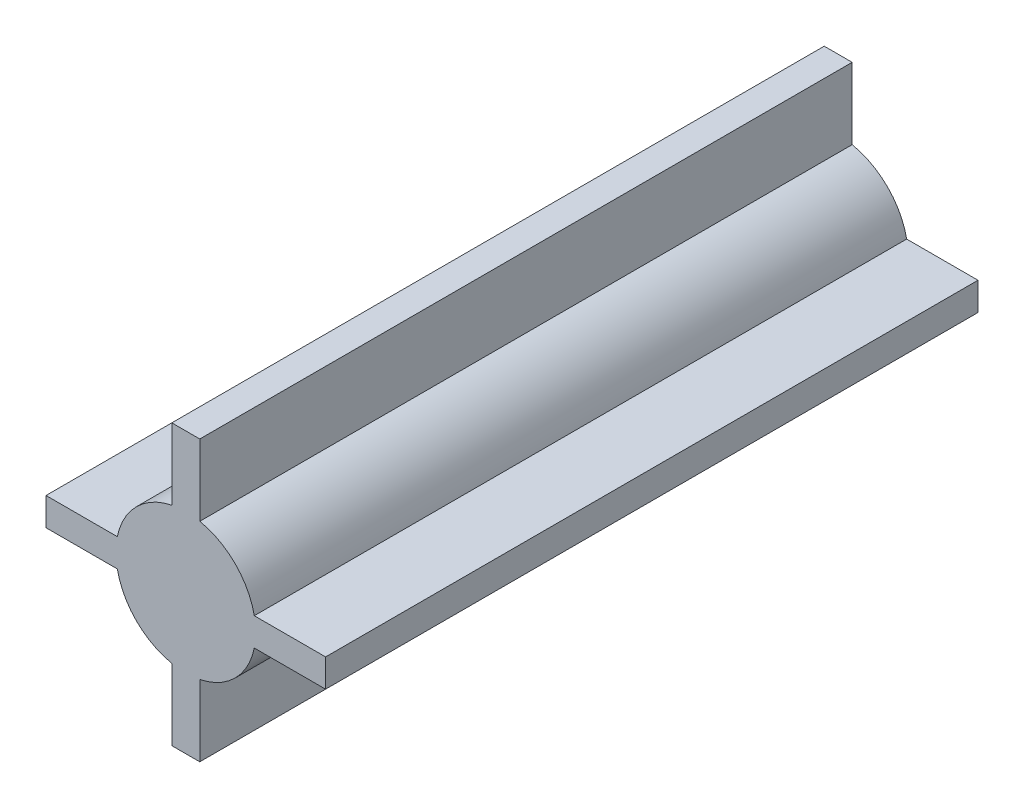
ISO-10303-21;
HEADER;
FILE_DESCRIPTION(('STEP AP214'),'2;1');
FILE_NAME('part.step','',(''),(''),'','','');
FILE_SCHEMA(('AUTOMOTIVE_DESIGN { 1 0 10303 214 1 1 1 1 }'));
ENDSEC;
DATA;
#1=APPLICATION_CONTEXT('core data for automotive mechanical design processes');
#2=APPLICATION_PROTOCOL_DEFINITION('international standard','automotive_design',2000,#1);
#3=PRODUCT_CONTEXT('',#1,'mechanical');
#4=PRODUCT('Part','Part','',(#3));
#5=PRODUCT_RELATED_PRODUCT_CATEGORY('part','',(#4));
#6=PRODUCT_DEFINITION_FORMATION('','',#4);
#7=PRODUCT_DEFINITION_CONTEXT('part definition',#1,'design');
#8=PRODUCT_DEFINITION('design','',#6,#7);
#9=PRODUCT_DEFINITION_SHAPE('','',#8);
#10=(LENGTH_UNIT() NAMED_UNIT(*) SI_UNIT(.MILLI.,.METRE.));
#11=(NAMED_UNIT(*) PLANE_ANGLE_UNIT() SI_UNIT($,.RADIAN.));
#12=(NAMED_UNIT(*) SI_UNIT($,.STERADIAN.) SOLID_ANGLE_UNIT());
#13=UNCERTAINTY_MEASURE_WITH_UNIT(LENGTH_MEASURE(1.E-05),#10,'distance_accuracy_value','');
#14=(GEOMETRIC_REPRESENTATION_CONTEXT(3) GLOBAL_UNCERTAINTY_ASSIGNED_CONTEXT((#13)) GLOBAL_UNIT_ASSIGNED_CONTEXT((#10,
#11,#12)) REPRESENTATION_CONTEXT('',''));
#15=CARTESIAN_POINT('',(0.,0.,0.));
#16=DIRECTION('',(0.,0.,1.));
#17=DIRECTION('',(1.,0.,0.));
#18=AXIS2_PLACEMENT_3D('',#15,#16,#17);
#19=CARTESIAN_POINT('',(0.,0.,0.));
#20=DIRECTION('',(0.,0.,-1.));
#21=DIRECTION('',(-1.,0.,0.));
#22=AXIS2_PLACEMENT_3D('',#19,#20,#21);
#23=PLANE('',#22);
#24=DIRECTION('',(0.,-1.,0.));
#25=VECTOR('',#24,1.);
#26=CARTESIAN_POINT('',(-1.50000000000038,14.9999999999995,0.));
#27=LINE('',#26,#25);
#28=CARTESIAN_POINT('',(-1.50000000000037,-7.34846922834946,0.));
#29=VERTEX_POINT('',#28);
#30=CARTESIAN_POINT('',(-1.50000000000037,-15.0000000000005,0.));
#31=VERTEX_POINT('',#30);
#32=EDGE_CURVE('E277',#29,#31,#27,.T.);
#33=ORIENTED_EDGE('',*,*,#32,.F.);
#34=CARTESIAN_POINT('',(0.,0.,0.));
#35=DIRECTION('',(0.,0.,1.));
#36=DIRECTION('',(1.,0.,0.));
#37=AXIS2_PLACEMENT_3D('',#34,#35,#36);
#38=CIRCLE('',#37,7.5);
#39=CARTESIAN_POINT('',(-7.34846922834953,-1.5,0.));
#40=VERTEX_POINT('',#39);
#41=EDGE_CURVE('E302',#40,#29,#38,.T.);
#42=ORIENTED_EDGE('',*,*,#41,.F.);
#43=DIRECTION('',(-1.,0.,0.));
#44=VECTOR('',#43,1.);
#45=CARTESIAN_POINT('',(15.,-1.5,0.));
#46=LINE('',#45,#44);
#47=CARTESIAN_POINT('',(-15.,-1.5,0.));
#48=VERTEX_POINT('',#47);
#49=EDGE_CURVE('E251',#40,#48,#46,.T.);
#50=ORIENTED_EDGE('',*,*,#49,.T.);
#51=DIRECTION('',(0.,1.,0.));
#52=VECTOR('',#51,1.);
#53=CARTESIAN_POINT('',(-15.,-1.5,0.));
#54=LINE('',#53,#52);
#55=CARTESIAN_POINT('',(-15.,1.5,0.));
#56=VERTEX_POINT('',#55);
#57=EDGE_CURVE('E248',#48,#56,#54,.T.);
#58=ORIENTED_EDGE('',*,*,#57,.T.);
#59=DIRECTION('',(-1.,0.,0.));
#60=VECTOR('',#59,1.);
#61=CARTESIAN_POINT('',(15.,1.5,0.));
#62=LINE('',#61,#60);
#63=CARTESIAN_POINT('',(-7.34846922834953,1.5,0.));
#64=VERTEX_POINT('',#63);
#65=EDGE_CURVE('E177',#64,#56,#62,.T.);
#66=ORIENTED_EDGE('',*,*,#65,.F.);
#67=CARTESIAN_POINT('',(-1.50000000000038,7.34846922834946,0.));
#68=VERTEX_POINT('',#67);
#69=EDGE_CURVE('E212',#68,#64,#38,.T.);
#70=ORIENTED_EDGE('',*,*,#69,.F.);
#71=CARTESIAN_POINT('',(-1.50000000000038,14.9999999999995,0.));
#72=VERTEX_POINT('',#71);
#73=EDGE_CURVE('E278',#72,#68,#27,.T.);
#74=ORIENTED_EDGE('',*,*,#73,.F.);
#75=DIRECTION('',(-1.,0.,0.));
#76=VECTOR('',#75,1.);
#77=CARTESIAN_POINT('',(1.49999999999962,14.9999999999995,0.));
#78=LINE('',#77,#76);
#79=CARTESIAN_POINT('',(1.49999999999962,14.9999999999995,0.));
#80=VERTEX_POINT('',#79);
#81=EDGE_CURVE('E222',#80,#72,#78,.T.);
#82=ORIENTED_EDGE('',*,*,#81,.F.);
#83=DIRECTION('',(0.,-1.,0.));
#84=VECTOR('',#83,1.);
#85=CARTESIAN_POINT('',(1.49999999999962,14.9999999999995,0.));
#86=LINE('',#85,#84);
#87=CARTESIAN_POINT('',(1.49999999999962,7.34846922834961,0.));
#88=VERTEX_POINT('',#87);
#89=EDGE_CURVE('E265',#80,#88,#86,.T.);
#90=ORIENTED_EDGE('',*,*,#89,.T.);
#91=CARTESIAN_POINT('',(7.34846922834953,1.5,0.));
#92=VERTEX_POINT('',#91);
#93=EDGE_CURVE('E303',#92,#88,#38,.T.);
#94=ORIENTED_EDGE('',*,*,#93,.F.);
#95=CARTESIAN_POINT('',(15.,1.5,0.));
#96=VERTEX_POINT('',#95);
#97=EDGE_CURVE('E245',#96,#92,#62,.T.);
#98=ORIENTED_EDGE('',*,*,#97,.F.);
#99=DIRECTION('',(0.,1.,0.));
#100=VECTOR('',#99,1.);
#101=CARTESIAN_POINT('',(15.,-1.5,0.));
#102=LINE('',#101,#100);
#103=CARTESIAN_POINT('',(15.,-1.5,0.));
#104=VERTEX_POINT('',#103);
#105=EDGE_CURVE('E230',#104,#96,#102,.T.);
#106=ORIENTED_EDGE('',*,*,#105,.F.);
#107=CARTESIAN_POINT('',(7.34846922834953,-1.5,0.));
#108=VERTEX_POINT('',#107);
#109=EDGE_CURVE('E233',#104,#108,#46,.T.);
#110=ORIENTED_EDGE('',*,*,#109,.T.);
#111=CARTESIAN_POINT('',(1.49999999999963,-7.34846922834961,0.));
#112=VERTEX_POINT('',#111);
#113=EDGE_CURVE('E299',#112,#108,#38,.T.);
#114=ORIENTED_EDGE('',*,*,#113,.F.);
#115=CARTESIAN_POINT('',(1.49999999999963,-15.0000000000005,0.));
#116=VERTEX_POINT('',#115);
#117=EDGE_CURVE('E284',#112,#116,#86,.T.);
#118=ORIENTED_EDGE('',*,*,#117,.T.);
#119=DIRECTION('',(-1.,0.,0.));
#120=VECTOR('',#119,1.);
#121=CARTESIAN_POINT('',(1.49999999999963,-15.0000000000005,0.));
#122=LINE('',#121,#120);
#123=EDGE_CURVE('E281',#116,#31,#122,.T.);
#124=ORIENTED_EDGE('',*,*,#123,.T.);
#125=EDGE_LOOP('',(#33,#42,#50,#58,#66,#70,#74,#82,#90,#94,#98,#106,#110,#114,#118,#124));
#126=FACE_BOUND('',#125,.T.);
#127=ADVANCED_FACE('F91',(#126),#23,.T.);
#128=CARTESIAN_POINT('',(15.,-1.5,70.));
#129=DIRECTION('',(-1.,0.,0.));
#130=DIRECTION('',(0.,0.,1.));
#131=AXIS2_PLACEMENT_3D('',#128,#129,#130);
#132=PLANE('',#131);
#133=ORIENTED_EDGE('',*,*,#105,.T.);
#134=DIRECTION('',(0.,0.,-1.));
#135=VECTOR('',#134,1.);
#136=CARTESIAN_POINT('',(15.,1.5,70.));
#137=LINE('',#136,#135);
#138=CARTESIAN_POINT('',(15.,1.5,70.));
#139=VERTEX_POINT('',#138);
#140=EDGE_CURVE('E244',#139,#96,#137,.T.);
#141=ORIENTED_EDGE('',*,*,#140,.F.);
#142=DIRECTION('',(0.,1.,0.));
#143=VECTOR('',#142,1.);
#144=CARTESIAN_POINT('',(15.,-1.5,70.));
#145=LINE('',#144,#143);
#146=CARTESIAN_POINT('',(15.,-1.5,70.));
#147=VERTEX_POINT('',#146);
#148=EDGE_CURVE('E241',#147,#139,#145,.T.);
#149=ORIENTED_EDGE('',*,*,#148,.F.);
#150=DIRECTION('',(0.,0.,-1.));
#151=VECTOR('',#150,1.);
#152=CARTESIAN_POINT('',(15.,-1.5,70.));
#153=LINE('',#152,#151);
#154=EDGE_CURVE('E256',#147,#104,#153,.T.);
#155=ORIENTED_EDGE('',*,*,#154,.T.);
#156=EDGE_LOOP('',(#133,#141,#149,#155));
#157=FACE_BOUND('',#156,.T.);
#158=ADVANCED_FACE('F326',(#157),#132,.F.);
#159=CARTESIAN_POINT('',(15.,1.5,70.));
#160=DIRECTION('',(0.,-1.,0.));
#161=DIRECTION('',(1.,0.,0.));
#162=AXIS2_PLACEMENT_3D('',#159,#160,#161);
#163=PLANE('',#162);
#164=DIRECTION('',(0.,0.,-1.));
#165=VECTOR('',#164,1.);
#166=CARTESIAN_POINT('',(7.34846922834953,1.5,70.));
#167=LINE('',#166,#165);
#168=CARTESIAN_POINT('',(7.34846922834953,1.5,70.));
#169=VERTEX_POINT('',#168);
#170=EDGE_CURVE('E12',#169,#92,#167,.T.);
#171=ORIENTED_EDGE('',*,*,#170,.F.);
#172=DIRECTION('',(-1.,0.,0.));
#173=VECTOR('',#172,1.);
#174=CARTESIAN_POINT('',(15.,1.5,70.));
#175=LINE('',#174,#173);
#176=EDGE_CURVE('E229',#139,#169,#175,.T.);
#177=ORIENTED_EDGE('',*,*,#176,.F.);
#178=ORIENTED_EDGE('',*,*,#140,.T.);
#179=ORIENTED_EDGE('',*,*,#97,.T.);
#180=EDGE_LOOP('',(#171,#177,#178,#179));
#181=FACE_BOUND('',#180,.T.);
#182=ADVANCED_FACE('F330',(#181),#163,.F.);
#183=CARTESIAN_POINT('',(15.,-1.5,70.));
#184=DIRECTION('',(0.,-1.,0.));
#185=DIRECTION('',(1.,0.,0.));
#186=AXIS2_PLACEMENT_3D('',#183,#184,#185);
#187=PLANE('',#186);
#188=DIRECTION('',(-1.,0.,0.));
#189=VECTOR('',#188,1.);
#190=CARTESIAN_POINT('',(15.,-1.5,70.));
#191=LINE('',#190,#189);
#192=CARTESIAN_POINT('',(7.34846922834953,-1.5,70.));
#193=VERTEX_POINT('',#192);
#194=EDGE_CURVE('E238',#147,#193,#191,.T.);
#195=ORIENTED_EDGE('',*,*,#194,.T.);
#196=DIRECTION('',(0.,0.,-1.));
#197=VECTOR('',#196,1.);
#198=CARTESIAN_POINT('',(7.34846922834953,-1.5,70.));
#199=LINE('',#198,#197);
#200=EDGE_CURVE('E214',#193,#108,#199,.T.);
#201=ORIENTED_EDGE('',*,*,#200,.T.);
#202=ORIENTED_EDGE('',*,*,#109,.F.);
#203=ORIENTED_EDGE('',*,*,#154,.F.);
#204=EDGE_LOOP('',(#195,#201,#202,#203));
#205=FACE_BOUND('',#204,.T.);
#206=ADVANCED_FACE('F314',(#205),#187,.T.);
#207=CARTESIAN_POINT('',(-15.,-1.5,70.));
#208=DIRECTION('',(-1.,0.,0.));
#209=DIRECTION('',(0.,0.,1.));
#210=AXIS2_PLACEMENT_3D('',#207,#208,#209);
#211=PLANE('',#210);
#212=ORIENTED_EDGE('',*,*,#57,.F.);
#213=DIRECTION('',(0.,0.,-1.));
#214=VECTOR('',#213,1.);
#215=CARTESIAN_POINT('',(-15.,-1.5,70.));
#216=LINE('',#215,#214);
#217=CARTESIAN_POINT('',(-15.,-1.5,70.));
#218=VERTEX_POINT('',#217);
#219=EDGE_CURVE('E258',#218,#48,#216,.T.);
#220=ORIENTED_EDGE('',*,*,#219,.F.);
#221=DIRECTION('',(0.,1.,0.));
#222=VECTOR('',#221,1.);
#223=CARTESIAN_POINT('',(-15.,-1.5,70.));
#224=LINE('',#223,#222);
#225=CARTESIAN_POINT('',(-15.,1.5,70.));
#226=VERTEX_POINT('',#225);
#227=EDGE_CURVE('E232',#218,#226,#224,.T.);
#228=ORIENTED_EDGE('',*,*,#227,.T.);
#229=DIRECTION('',(0.,0.,-1.));
#230=VECTOR('',#229,1.);
#231=CARTESIAN_POINT('',(-15.,1.5,70.));
#232=LINE('',#231,#230);
#233=EDGE_CURVE('E227',#226,#56,#232,.T.);
#234=ORIENTED_EDGE('',*,*,#233,.T.);
#235=EDGE_LOOP('',(#212,#220,#228,#234));
#236=FACE_BOUND('',#235,.T.);
#237=ADVANCED_FACE('F340',(#236),#211,.T.);
#238=ORIENTED_EDGE('',*,*,#49,.F.);
#239=DIRECTION('',(0.,0.,-1.));
#240=VECTOR('',#239,1.);
#241=CARTESIAN_POINT('',(-7.34846922834953,-1.5,70.));
#242=LINE('',#241,#240);
#243=CARTESIAN_POINT('',(-7.34846922834953,-1.5,70.));
#244=VERTEX_POINT('',#243);
#245=EDGE_CURVE('E108',#40,#244,#242,.F.);
#246=ORIENTED_EDGE('',*,*,#245,.T.);
#247=EDGE_CURVE('E237',#244,#218,#191,.T.);
#248=ORIENTED_EDGE('',*,*,#247,.T.);
#249=ORIENTED_EDGE('',*,*,#219,.T.);
#250=EDGE_LOOP('',(#238,#246,#248,#249));
#251=FACE_BOUND('',#250,.T.);
#252=ADVANCED_FACE('F337',(#251),#187,.T.);
#253=DIRECTION('',(0.,0.,-1.));
#254=VECTOR('',#253,1.);
#255=CARTESIAN_POINT('',(-7.34846922834953,1.5,70.));
#256=LINE('',#255,#254);
#257=CARTESIAN_POINT('',(-7.34846922834953,1.5,70.));
#258=VERTEX_POINT('',#257);
#259=EDGE_CURVE('E100',#64,#258,#256,.F.);
#260=ORIENTED_EDGE('',*,*,#259,.F.);
#261=ORIENTED_EDGE('',*,*,#65,.T.);
#262=ORIENTED_EDGE('',*,*,#233,.F.);
#263=EDGE_CURVE('E219',#258,#226,#175,.T.);
#264=ORIENTED_EDGE('',*,*,#263,.F.);
#265=EDGE_LOOP('',(#260,#261,#262,#264));
#266=FACE_BOUND('',#265,.T.);
#267=ADVANCED_FACE('F226',(#266),#163,.F.);
#268=CARTESIAN_POINT('',(0.,0.,70.));
#269=DIRECTION('',(0.,0.,-1.));
#270=DIRECTION('',(-1.,0.,0.));
#271=AXIS2_PLACEMENT_3D('',#268,#269,#270);
#272=PLANE('',#271);
#273=CARTESIAN_POINT('',(0.,0.,70.));
#274=DIRECTION('',(0.,0.,1.));
#275=DIRECTION('',(1.,0.,0.));
#276=AXIS2_PLACEMENT_3D('',#273,#274,#275);
#277=CIRCLE('',#276,7.5);
#278=CARTESIAN_POINT('',(-1.50000000000037,-7.34846922834946,70.));
#279=VERTEX_POINT('',#278);
#280=EDGE_CURVE('E223',#244,#279,#277,.T.);
#281=ORIENTED_EDGE('',*,*,#280,.T.);
#282=DIRECTION('',(0.,-1.,0.));
#283=VECTOR('',#282,1.);
#284=CARTESIAN_POINT('',(-1.50000000000038,14.9999999999995,70.));
#285=LINE('',#284,#283);
#286=CARTESIAN_POINT('',(-1.50000000000037,-15.0000000000005,70.));
#287=VERTEX_POINT('',#286);
#288=EDGE_CURVE('E264',#279,#287,#285,.T.);
#289=ORIENTED_EDGE('',*,*,#288,.T.);
#290=DIRECTION('',(-1.,0.,0.));
#291=VECTOR('',#290,1.);
#292=CARTESIAN_POINT('',(1.49999999999963,-15.0000000000005,70.));
#293=LINE('',#292,#291);
#294=CARTESIAN_POINT('',(1.49999999999963,-15.0000000000005,70.));
#295=VERTEX_POINT('',#294);
#296=EDGE_CURVE('E267',#295,#287,#293,.T.);
#297=ORIENTED_EDGE('',*,*,#296,.F.);
#298=DIRECTION('',(0.,-1.,0.));
#299=VECTOR('',#298,1.);
#300=CARTESIAN_POINT('',(1.49999999999962,14.9999999999995,70.));
#301=LINE('',#300,#299);
#302=CARTESIAN_POINT('',(1.49999999999963,-7.34846922834961,70.));
#303=VERTEX_POINT('',#302);
#304=EDGE_CURVE('E270',#303,#295,#301,.T.);
#305=ORIENTED_EDGE('',*,*,#304,.F.);
#306=EDGE_CURVE('E225',#303,#193,#277,.T.);
#307=ORIENTED_EDGE('',*,*,#306,.T.);
#308=ORIENTED_EDGE('',*,*,#194,.F.);
#309=ORIENTED_EDGE('',*,*,#148,.T.);
#310=ORIENTED_EDGE('',*,*,#176,.T.);
#311=CARTESIAN_POINT('',(1.49999999999962,7.34846922834961,70.));
#312=VERTEX_POINT('',#311);
#313=EDGE_CURVE('E162',#169,#312,#277,.T.);
#314=ORIENTED_EDGE('',*,*,#313,.T.);
#315=CARTESIAN_POINT('',(1.49999999999962,14.9999999999995,70.));
#316=VERTEX_POINT('',#315);
#317=EDGE_CURVE('E271',#316,#312,#301,.T.);
#318=ORIENTED_EDGE('',*,*,#317,.F.);
#319=DIRECTION('',(-1.,0.,0.));
#320=VECTOR('',#319,1.);
#321=CARTESIAN_POINT('',(1.49999999999962,14.9999999999995,70.));
#322=LINE('',#321,#320);
#323=CARTESIAN_POINT('',(-1.50000000000038,14.9999999999995,70.));
#324=VERTEX_POINT('',#323);
#325=EDGE_CURVE('E262',#316,#324,#322,.T.);
#326=ORIENTED_EDGE('',*,*,#325,.T.);
#327=CARTESIAN_POINT('',(-1.50000000000038,7.34846922834946,70.));
#328=VERTEX_POINT('',#327);
#329=EDGE_CURVE('E221',#324,#328,#285,.T.);
#330=ORIENTED_EDGE('',*,*,#329,.T.);
#331=EDGE_CURVE('E209',#328,#258,#277,.T.);
#332=ORIENTED_EDGE('',*,*,#331,.T.);
#333=ORIENTED_EDGE('',*,*,#263,.T.);
#334=ORIENTED_EDGE('',*,*,#227,.F.);
#335=ORIENTED_EDGE('',*,*,#247,.F.);
#336=EDGE_LOOP('',(#281,#289,#297,#305,#307,#308,#309,#310,#314,#318,#326,#330,#332,#333,#334,#335));
#337=FACE_BOUND('',#336,.T.);
#338=ADVANCED_FACE('F217',(#337),#272,.F.);
#339=CARTESIAN_POINT('',(1.49999999999963,-15.0000000000005,70.));
#340=DIRECTION('',(0.,-1.,0.));
#341=DIRECTION('',(0.,0.,-1.));
#342=AXIS2_PLACEMENT_3D('',#339,#340,#341);
#343=PLANE('',#342);
#344=ORIENTED_EDGE('',*,*,#123,.F.);
#345=DIRECTION('',(0.,0.,-1.));
#346=VECTOR('',#345,1.);
#347=CARTESIAN_POINT('',(1.49999999999963,-15.0000000000005,70.));
#348=LINE('',#347,#346);
#349=EDGE_CURVE('E288',#295,#116,#348,.T.);
#350=ORIENTED_EDGE('',*,*,#349,.F.);
#351=ORIENTED_EDGE('',*,*,#296,.T.);
#352=DIRECTION('',(0.,0.,-1.));
#353=VECTOR('',#352,1.);
#354=CARTESIAN_POINT('',(-1.50000000000037,-15.0000000000005,70.));
#355=LINE('',#354,#353);
#356=EDGE_CURVE('E291',#287,#31,#355,.T.);
#357=ORIENTED_EDGE('',*,*,#356,.T.);
#358=EDGE_LOOP('',(#344,#350,#351,#357));
#359=FACE_BOUND('',#358,.T.);
#360=ADVANCED_FACE('F380',(#359),#343,.T.);
#361=CARTESIAN_POINT('',(1.49999999999962,14.9999999999995,70.));
#362=DIRECTION('',(1.,0.,0.));
#363=DIRECTION('',(0.,1.,0.));
#364=AXIS2_PLACEMENT_3D('',#361,#362,#363);
#365=PLANE('',#364);
#366=ORIENTED_EDGE('',*,*,#117,.F.);
#367=DIRECTION('',(0.,0.,-1.));
#368=VECTOR('',#367,1.);
#369=CARTESIAN_POINT('',(1.49999999999963,-7.34846922834961,70.));
#370=LINE('',#369,#368);
#371=EDGE_CURVE('E168',#112,#303,#370,.F.);
#372=ORIENTED_EDGE('',*,*,#371,.T.);
#373=ORIENTED_EDGE('',*,*,#304,.T.);
#374=ORIENTED_EDGE('',*,*,#349,.T.);
#375=EDGE_LOOP('',(#366,#372,#373,#374));
#376=FACE_BOUND('',#375,.T.);
#377=ADVANCED_FACE('F365',(#376),#365,.T.);
#378=CARTESIAN_POINT('',(-1.50000000000038,14.9999999999995,70.));
#379=DIRECTION('',(1.,0.,0.));
#380=DIRECTION('',(0.,1.,0.));
#381=AXIS2_PLACEMENT_3D('',#378,#379,#380);
#382=PLANE('',#381);
#383=DIRECTION('',(0.,0.,-1.));
#384=VECTOR('',#383,1.);
#385=CARTESIAN_POINT('',(-1.50000000000037,-7.34846922834946,70.));
#386=LINE('',#385,#384);
#387=EDGE_CURVE('E309',#29,#279,#386,.F.);
#388=ORIENTED_EDGE('',*,*,#387,.F.);
#389=ORIENTED_EDGE('',*,*,#32,.T.);
#390=ORIENTED_EDGE('',*,*,#356,.F.);
#391=ORIENTED_EDGE('',*,*,#288,.F.);
#392=EDGE_LOOP('',(#388,#389,#390,#391));
#393=FACE_BOUND('',#392,.T.);
#394=ADVANCED_FACE('F358',(#393),#382,.F.);
#395=CARTESIAN_POINT('',(0.,0.,70.));
#396=DIRECTION('',(0.,0.,-1.));
#397=DIRECTION('',(-1.,0.,0.));
#398=AXIS2_PLACEMENT_3D('',#395,#396,#397);
#399=CYLINDRICAL_SURFACE('',#398,7.5);
#400=ORIENTED_EDGE('',*,*,#245,.F.);
#401=ORIENTED_EDGE('',*,*,#41,.T.);
#402=ORIENTED_EDGE('',*,*,#387,.T.);
#403=ORIENTED_EDGE('',*,*,#280,.F.);
#404=EDGE_LOOP('',(#400,#401,#402,#403));
#405=FACE_BOUND('',#404,.T.);
#406=ADVANCED_FACE('F363',(#405),#399,.T.);
#407=ORIENTED_EDGE('',*,*,#200,.F.);
#408=ORIENTED_EDGE('',*,*,#306,.F.);
#409=ORIENTED_EDGE('',*,*,#371,.F.);
#410=ORIENTED_EDGE('',*,*,#113,.T.);
#411=EDGE_LOOP('',(#407,#408,#409,#410));
#412=FACE_BOUND('',#411,.T.);
#413=ADVANCED_FACE('F93',(#412),#399,.T.);
#414=CARTESIAN_POINT('',(1.49999999999962,14.9999999999995,70.));
#415=DIRECTION('',(0.,-1.,0.));
#416=DIRECTION('',(0.,0.,-1.));
#417=AXIS2_PLACEMENT_3D('',#414,#415,#416);
#418=PLANE('',#417);
#419=ORIENTED_EDGE('',*,*,#81,.T.);
#420=DIRECTION('',(0.,0.,-1.));
#421=VECTOR('',#420,1.);
#422=CARTESIAN_POINT('',(-1.50000000000038,14.9999999999995,70.));
#423=LINE('',#422,#421);
#424=EDGE_CURVE('E294',#324,#72,#423,.T.);
#425=ORIENTED_EDGE('',*,*,#424,.F.);
#426=ORIENTED_EDGE('',*,*,#325,.F.);
#427=DIRECTION('',(0.,0.,-1.));
#428=VECTOR('',#427,1.);
#429=CARTESIAN_POINT('',(1.49999999999962,14.9999999999995,70.));
#430=LINE('',#429,#428);
#431=EDGE_CURVE('E274',#316,#80,#430,.T.);
#432=ORIENTED_EDGE('',*,*,#431,.T.);
#433=EDGE_LOOP('',(#419,#425,#426,#432));
#434=FACE_BOUND('',#433,.T.);
#435=ADVANCED_FACE('F352',(#434),#418,.F.);
#436=ORIENTED_EDGE('',*,*,#317,.T.);
#437=DIRECTION('',(0.,0.,-1.));
#438=VECTOR('',#437,1.);
#439=CARTESIAN_POINT('',(1.49999999999962,7.34846922834961,70.));
#440=LINE('',#439,#438);
#441=EDGE_CURVE('E296',#312,#88,#440,.T.);
#442=ORIENTED_EDGE('',*,*,#441,.T.);
#443=ORIENTED_EDGE('',*,*,#89,.F.);
#444=ORIENTED_EDGE('',*,*,#431,.F.);
#445=EDGE_LOOP('',(#436,#442,#443,#444));
#446=FACE_BOUND('',#445,.T.);
#447=ADVANCED_FACE('F348',(#446),#365,.T.);
#448=DIRECTION('',(0.,0.,-1.));
#449=VECTOR('',#448,1.);
#450=CARTESIAN_POINT('',(-1.50000000000038,7.34846922834946,70.));
#451=LINE('',#450,#449);
#452=EDGE_CURVE('E307',#328,#68,#451,.T.);
#453=ORIENTED_EDGE('',*,*,#452,.F.);
#454=ORIENTED_EDGE('',*,*,#329,.F.);
#455=ORIENTED_EDGE('',*,*,#424,.T.);
#456=ORIENTED_EDGE('',*,*,#73,.T.);
#457=EDGE_LOOP('',(#453,#454,#455,#456));
#458=FACE_BOUND('',#457,.T.);
#459=ADVANCED_FACE('F355',(#458),#382,.F.);
#460=ORIENTED_EDGE('',*,*,#69,.T.);
#461=ORIENTED_EDGE('',*,*,#259,.T.);
#462=ORIENTED_EDGE('',*,*,#331,.F.);
#463=ORIENTED_EDGE('',*,*,#452,.T.);
#464=EDGE_LOOP('',(#460,#461,#462,#463));
#465=FACE_BOUND('',#464,.T.);
#466=ADVANCED_FACE('F208',(#465),#399,.T.);
#467=ORIENTED_EDGE('',*,*,#313,.F.);
#468=ORIENTED_EDGE('',*,*,#170,.T.);
#469=ORIENTED_EDGE('',*,*,#93,.T.);
#470=ORIENTED_EDGE('',*,*,#441,.F.);
#471=EDGE_LOOP('',(#467,#468,#469,#470));
#472=FACE_BOUND('',#471,.T.);
#473=ADVANCED_FACE('F345',(#472),#399,.T.);
#474=CLOSED_SHELL('',(#127,#158,#182,#206,#237,#252,#267,#338,#360,#377,#394,#406,#413,#435,
#447,#459,#466,#473));
#475=MANIFOLD_SOLID_BREP('B2',#474);
#476=ADVANCED_BREP_SHAPE_REPRESENTATION('',(#18,#475),#14);
#477=SHAPE_DEFINITION_REPRESENTATION(#9,#476);
ENDSEC;
END-ISO-10303-21;
